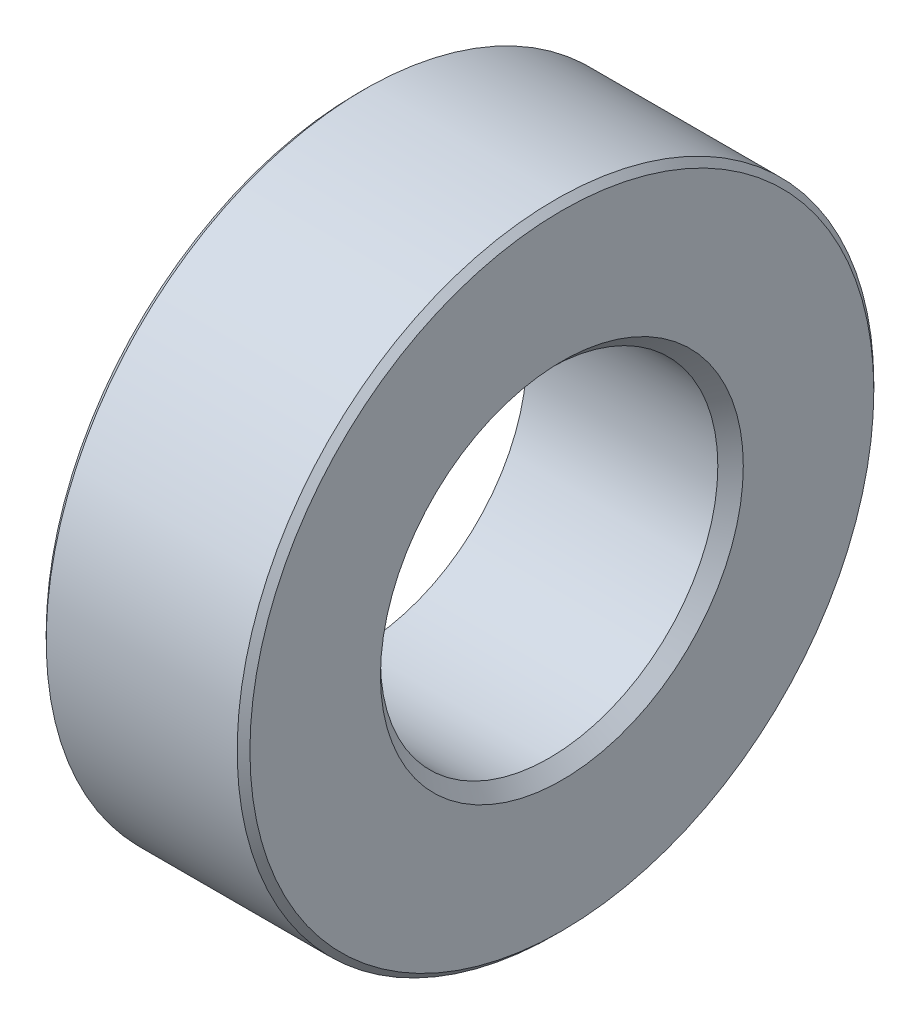
ISO-10303-21;
HEADER;
FILE_DESCRIPTION(('STEP AP214'),'2;1');
FILE_NAME('part.step','',(''),(''),'','','');
FILE_SCHEMA(('AUTOMOTIVE_DESIGN { 1 0 10303 214 1 1 1 1 }'));
ENDSEC;
DATA;
#1=APPLICATION_CONTEXT('core data for automotive mechanical design processes');
#2=APPLICATION_PROTOCOL_DEFINITION('international standard','automotive_design',2000,#1);
#3=PRODUCT_CONTEXT('',#1,'mechanical');
#4=PRODUCT('Part','Part','',(#3));
#5=PRODUCT_RELATED_PRODUCT_CATEGORY('part','',(#4));
#6=PRODUCT_DEFINITION_FORMATION('','',#4);
#7=PRODUCT_DEFINITION_CONTEXT('part definition',#1,'design');
#8=PRODUCT_DEFINITION('design','',#6,#7);
#9=PRODUCT_DEFINITION_SHAPE('','',#8);
#10=(LENGTH_UNIT() NAMED_UNIT(*) SI_UNIT(.MILLI.,.METRE.));
#11=(NAMED_UNIT(*) PLANE_ANGLE_UNIT() SI_UNIT($,.RADIAN.));
#12=(NAMED_UNIT(*) SI_UNIT($,.STERADIAN.) SOLID_ANGLE_UNIT());
#13=UNCERTAINTY_MEASURE_WITH_UNIT(LENGTH_MEASURE(1.E-05),#10,'distance_accuracy_value','');
#14=(GEOMETRIC_REPRESENTATION_CONTEXT(3) GLOBAL_UNCERTAINTY_ASSIGNED_CONTEXT((#13)) GLOBAL_UNIT_ASSIGNED_CONTEXT((#10,
#11,#12)) REPRESENTATION_CONTEXT('',''));
#15=CARTESIAN_POINT('',(0.,0.,0.));
#16=DIRECTION('',(0.,0.,1.));
#17=DIRECTION('',(1.,0.,0.));
#18=AXIS2_PLACEMENT_3D('',#15,#16,#17);
#19=CARTESIAN_POINT('',(3.2,0.,0.));
#20=DIRECTION('',(1.,0.,0.));
#21=DIRECTION('',(0.,0.,-1.));
#22=AXIS2_PLACEMENT_3D('',#19,#20,#21);
#23=PLANE('',#22);
#24=CARTESIAN_POINT('',(3.2,0.,0.));
#25=DIRECTION('',(1.,0.,0.));
#26=DIRECTION('',(0.,0.,-1.));
#27=AXIS2_PLACEMENT_3D('',#24,#25,#26);
#28=CIRCLE('',#27,2.85);
#29=CARTESIAN_POINT('',(3.2,0.,-2.85));
#30=VERTEX_POINT('',#29);
#31=EDGE_CURVE('E8',#30,#30,#28,.F.);
#32=ORIENTED_EDGE('',*,*,#31,.T.);
#33=EDGE_LOOP('',(#32));
#34=FACE_BOUND('',#33,.T.);
#35=CARTESIAN_POINT('',(3.2,0.,0.));
#36=DIRECTION('',(1.,0.,0.));
#37=DIRECTION('',(0.,0.,-1.));
#38=AXIS2_PLACEMENT_3D('',#35,#36,#37);
#39=CIRCLE('',#38,4.9);
#40=CARTESIAN_POINT('',(3.2,0.,-4.9));
#41=VERTEX_POINT('',#40);
#42=EDGE_CURVE('E24',#41,#41,#39,.T.);
#43=ORIENTED_EDGE('',*,*,#42,.T.);
#44=EDGE_LOOP('',(#43));
#45=FACE_BOUND('',#44,.T.);
#46=ADVANCED_FACE('F13',(#34,#45),#23,.T.);
#47=CARTESIAN_POINT('',(0.,0.,0.));
#48=DIRECTION('',(1.,0.,0.));
#49=DIRECTION('',(0.,0.,-1.));
#50=AXIS2_PLACEMENT_3D('',#47,#48,#49);
#51=PLANE('',#50);
#52=CARTESIAN_POINT('',(0.,0.,0.));
#53=DIRECTION('',(1.,0.,0.));
#54=DIRECTION('',(0.,0.,-1.));
#55=AXIS2_PLACEMENT_3D('',#52,#53,#54);
#56=CIRCLE('',#55,4.9);
#57=CARTESIAN_POINT('',(0.,0.,-4.9));
#58=VERTEX_POINT('',#57);
#59=EDGE_CURVE('E28',#58,#58,#56,.F.);
#60=ORIENTED_EDGE('',*,*,#59,.T.);
#61=EDGE_LOOP('',(#60));
#62=FACE_BOUND('',#61,.T.);
#63=CARTESIAN_POINT('',(0.,0.,0.));
#64=DIRECTION('',(1.,0.,0.));
#65=DIRECTION('',(0.,0.,-1.));
#66=AXIS2_PLACEMENT_3D('',#63,#64,#65);
#67=CIRCLE('',#66,2.65);
#68=CARTESIAN_POINT('',(0.,0.,-2.65));
#69=VERTEX_POINT('',#68);
#70=EDGE_CURVE('E39',#69,#69,#67,.T.);
#71=ORIENTED_EDGE('',*,*,#70,.T.);
#72=EDGE_LOOP('',(#71));
#73=FACE_BOUND('',#72,.T.);
#74=ADVANCED_FACE('F43',(#62,#73),#51,.F.);
#75=CARTESIAN_POINT('',(3.2,0.,0.));
#76=DIRECTION('',(-1.,0.,0.));
#77=DIRECTION('',(0.,0.,1.));
#78=AXIS2_PLACEMENT_3D('',#75,#76,#77);
#79=CYLINDRICAL_SURFACE('',#78,5.);
#80=CARTESIAN_POINT('',(0.1,0.,0.));
#81=DIRECTION('',(1.,0.,0.));
#82=DIRECTION('',(0.,0.,-1.));
#83=AXIS2_PLACEMENT_3D('',#80,#81,#82);
#84=CIRCLE('',#83,5.);
#85=CARTESIAN_POINT('',(0.1,0.,-5.));
#86=VERTEX_POINT('',#85);
#87=EDGE_CURVE('E33',#86,#86,#84,.T.);
#88=ORIENTED_EDGE('',*,*,#87,.T.);
#89=EDGE_LOOP('',(#88));
#90=FACE_BOUND('',#89,.T.);
#91=CARTESIAN_POINT('',(3.1,0.,0.));
#92=DIRECTION('',(1.,0.,0.));
#93=DIRECTION('',(0.,0.,-1.));
#94=AXIS2_PLACEMENT_3D('',#91,#92,#93);
#95=CIRCLE('',#94,5.);
#96=CARTESIAN_POINT('',(3.1,0.,-5.));
#97=VERTEX_POINT('',#96);
#98=EDGE_CURVE('E36',#97,#97,#95,.F.);
#99=ORIENTED_EDGE('',*,*,#98,.T.);
#100=EDGE_LOOP('',(#99));
#101=FACE_BOUND('',#100,.T.);
#102=ADVANCED_FACE('F48',(#90,#101),#79,.T.);
#103=CARTESIAN_POINT('',(3.2,0.,0.));
#104=DIRECTION('',(-1.,0.,0.));
#105=DIRECTION('',(0.,0.,1.));
#106=AXIS2_PLACEMENT_3D('',#103,#104,#105);
#107=CYLINDRICAL_SURFACE('',#106,2.65);
#108=CARTESIAN_POINT('',(3.00000000000001,0.,0.));
#109=DIRECTION('',(1.,0.,0.));
#110=DIRECTION('',(0.,0.,-1.));
#111=AXIS2_PLACEMENT_3D('',#108,#109,#110);
#112=CIRCLE('',#111,2.65);
#113=CARTESIAN_POINT('',(3.00000000000001,0.,-2.65));
#114=VERTEX_POINT('',#113);
#115=EDGE_CURVE('E20',#114,#114,#112,.T.);
#116=ORIENTED_EDGE('',*,*,#115,.T.);
#117=EDGE_LOOP('',(#116));
#118=FACE_BOUND('',#117,.T.);
#119=ORIENTED_EDGE('',*,*,#70,.F.);
#120=EDGE_LOOP('',(#119));
#121=FACE_BOUND('',#120,.T.);
#122=ADVANCED_FACE('F45',(#118,#121),#107,.F.);
#123=CARTESIAN_POINT('',(0.1,0.,0.));
#124=DIRECTION('',(1.,0.,0.));
#125=DIRECTION('',(0.,0.,-1.));
#126=AXIS2_PLACEMENT_3D('',#123,#124,#125);
#127=CONICAL_SURFACE('',#126,5.,0.785398163397444);
#128=ORIENTED_EDGE('',*,*,#59,.F.);
#129=EDGE_LOOP('',(#128));
#130=FACE_BOUND('',#129,.T.);
#131=ORIENTED_EDGE('',*,*,#87,.F.);
#132=EDGE_LOOP('',(#131));
#133=FACE_BOUND('',#132,.T.);
#134=ADVANCED_FACE('F47',(#130,#133),#127,.T.);
#135=CARTESIAN_POINT('',(3.2,0.,0.));
#136=DIRECTION('',(-1.,0.,0.));
#137=DIRECTION('',(0.,0.,1.));
#138=AXIS2_PLACEMENT_3D('',#135,#136,#137);
#139=CONICAL_SURFACE('',#138,4.9,0.78539816339744);
#140=ORIENTED_EDGE('',*,*,#98,.F.);
#141=EDGE_LOOP('',(#140));
#142=FACE_BOUND('',#141,.T.);
#143=ORIENTED_EDGE('',*,*,#42,.F.);
#144=EDGE_LOOP('',(#143));
#145=FACE_BOUND('',#144,.T.);
#146=ADVANCED_FACE('F55',(#142,#145),#139,.T.);
#147=CARTESIAN_POINT('',(3.00000000000001,0.,0.));
#148=DIRECTION('',(1.,0.,0.));
#149=DIRECTION('',(0.,0.,-1.));
#150=AXIS2_PLACEMENT_3D('',#147,#148,#149);
#151=CONICAL_SURFACE('',#150,2.65,0.785398163397453);
#152=ORIENTED_EDGE('',*,*,#31,.F.);
#153=EDGE_LOOP('',(#152));
#154=FACE_BOUND('',#153,.T.);
#155=ORIENTED_EDGE('',*,*,#115,.F.);
#156=EDGE_LOOP('',(#155));
#157=FACE_BOUND('',#156,.T.);
#158=ADVANCED_FACE('F15',(#154,#157),#151,.F.);
#159=CLOSED_SHELL('',(#46,#74,#102,#122,#134,#146,#158));
#160=MANIFOLD_SOLID_BREP('B1',#159);
#161=ADVANCED_BREP_SHAPE_REPRESENTATION('',(#18,#160),#14);
#162=SHAPE_DEFINITION_REPRESENTATION(#9,#161);
ENDSEC;
END-ISO-10303-21;
